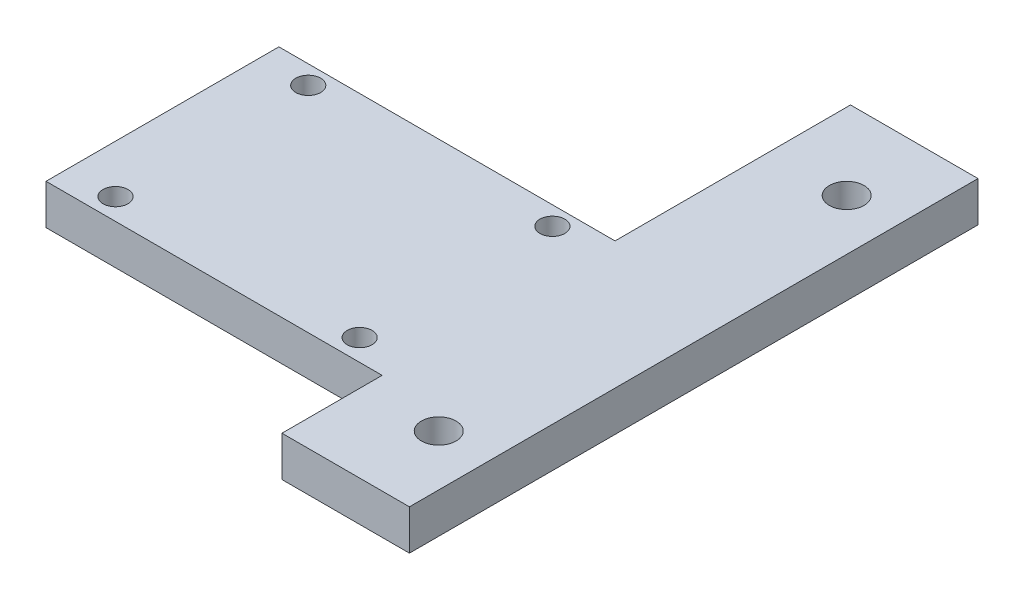
ISO-10303-21;
HEADER;
FILE_DESCRIPTION(('STEP AP214'),'2;1');
FILE_NAME('part.step','',(''),(''),'','','');
FILE_SCHEMA(('AUTOMOTIVE_DESIGN { 1 0 10303 214 1 1 1 1 }'));
ENDSEC;
DATA;
#1=APPLICATION_CONTEXT('core data for automotive mechanical design processes');
#2=APPLICATION_PROTOCOL_DEFINITION('international standard','automotive_design',2000,#1);
#3=PRODUCT_CONTEXT('',#1,'mechanical');
#4=PRODUCT('Part','Part','',(#3));
#5=PRODUCT_RELATED_PRODUCT_CATEGORY('part','',(#4));
#6=PRODUCT_DEFINITION_FORMATION('','',#4);
#7=PRODUCT_DEFINITION_CONTEXT('part definition',#1,'design');
#8=PRODUCT_DEFINITION('design','',#6,#7);
#9=PRODUCT_DEFINITION_SHAPE('','',#8);
#10=(LENGTH_UNIT() NAMED_UNIT(*) SI_UNIT(.MILLI.,.METRE.));
#11=(NAMED_UNIT(*) PLANE_ANGLE_UNIT() SI_UNIT($,.RADIAN.));
#12=(NAMED_UNIT(*) SI_UNIT($,.STERADIAN.) SOLID_ANGLE_UNIT());
#13=UNCERTAINTY_MEASURE_WITH_UNIT(LENGTH_MEASURE(1.E-05),#10,'distance_accuracy_value','');
#14=(GEOMETRIC_REPRESENTATION_CONTEXT(3) GLOBAL_UNCERTAINTY_ASSIGNED_CONTEXT((#13)) GLOBAL_UNIT_ASSIGNED_CONTEXT((#10,
#11,#12)) REPRESENTATION_CONTEXT('',''));
#15=CARTESIAN_POINT('',(0.,0.,0.));
#16=DIRECTION('',(0.,0.,1.));
#17=DIRECTION('',(1.,0.,0.));
#18=AXIS2_PLACEMENT_3D('',#15,#16,#17);
#19=CARTESIAN_POINT('',(0.,5.,0.));
#20=DIRECTION('',(0.,-1.,0.));
#21=DIRECTION('',(0.,0.,-1.));
#22=AXIS2_PLACEMENT_3D('',#19,#20,#21);
#23=PLANE('',#22);
#24=DIRECTION('',(-1.,0.,0.));
#25=VECTOR('',#24,1.);
#26=CARTESIAN_POINT('',(20.675,5.,-27.14922));
#27=LINE('',#26,#25);
#28=CARTESIAN_POINT('',(36.55,5.,-27.14922));
#29=VERTEX_POINT('',#28);
#30=CARTESIAN_POINT('',(20.675,5.,-27.14922));
#31=VERTEX_POINT('',#30);
#32=EDGE_CURVE('E145',#29,#31,#27,.T.);
#33=ORIENTED_EDGE('',*,*,#32,.T.);
#34=DIRECTION('',(0.,0.,1.));
#35=VECTOR('',#34,1.);
#36=CARTESIAN_POINT('',(20.675,5.,2.1739551283588));
#37=LINE('',#36,#35);
#38=CARTESIAN_POINT('',(20.675,5.,2.1739551283588));
#39=VERTEX_POINT('',#38);
#40=EDGE_CURVE('E93',#31,#39,#37,.T.);
#41=ORIENTED_EDGE('',*,*,#40,.T.);
#42=DIRECTION('',(-1.,0.,0.));
#43=VECTOR('',#42,1.);
#44=CARTESIAN_POINT('',(-21.18269604,5.,2.1739551283588));
#45=LINE('',#44,#43);
#46=CARTESIAN_POINT('',(-21.18269604,5.,2.1739551283588));
#47=VERTEX_POINT('',#46);
#48=EDGE_CURVE('E160',#39,#47,#45,.T.);
#49=ORIENTED_EDGE('',*,*,#48,.T.);
#50=DIRECTION('',(0.,0.,1.));
#51=VECTOR('',#50,1.);
#52=CARTESIAN_POINT('',(-21.18269604,5.,31.1739551283588));
#53=LINE('',#52,#51);
#54=CARTESIAN_POINT('',(-21.18269604,5.,31.1739551283588));
#55=VERTEX_POINT('',#54);
#56=EDGE_CURVE('E173',#47,#55,#53,.T.);
#57=ORIENTED_EDGE('',*,*,#56,.T.);
#58=DIRECTION('',(1.,0.,0.));
#59=VECTOR('',#58,1.);
#60=CARTESIAN_POINT('',(20.675,5.,31.1739551283588));
#61=LINE('',#60,#59);
#62=CARTESIAN_POINT('',(20.675,5.,31.1739551283588));
#63=VERTEX_POINT('',#62);
#64=EDGE_CURVE('E112',#55,#63,#61,.T.);
#65=ORIENTED_EDGE('',*,*,#64,.T.);
#66=DIRECTION('',(0.,0.,1.));
#67=VECTOR('',#66,1.);
#68=CARTESIAN_POINT('',(20.675,5.,31.1739551283588));
#69=LINE('',#68,#67);
#70=CARTESIAN_POINT('',(20.675,5.,43.65078));
#71=VERTEX_POINT('',#70);
#72=EDGE_CURVE('E106',#63,#71,#69,.T.);
#73=ORIENTED_EDGE('',*,*,#72,.T.);
#74=DIRECTION('',(1.,0.,0.));
#75=VECTOR('',#74,1.);
#76=CARTESIAN_POINT('',(20.675,5.,43.65078));
#77=LINE('',#76,#75);
#78=CARTESIAN_POINT('',(36.55,5.,43.65078));
#79=VERTEX_POINT('',#78);
#80=EDGE_CURVE('E110',#71,#79,#77,.T.);
#81=ORIENTED_EDGE('',*,*,#80,.T.);
#82=DIRECTION('',(0.,0.,-1.));
#83=VECTOR('',#82,1.);
#84=CARTESIAN_POINT('',(36.55,5.,-27.14922));
#85=LINE('',#84,#83);
#86=EDGE_CURVE('E50',#79,#29,#85,.T.);
#87=ORIENTED_EDGE('',*,*,#86,.T.);
#88=EDGE_LOOP('',(#33,#41,#49,#57,#65,#73,#81,#87));
#89=FACE_BOUND('',#88,.T.);
#90=CARTESIAN_POINT('',(30.2,5.,33.65078));
#91=DIRECTION('',(0.,1.,0.));
#92=DIRECTION('',(0.,0.,-1.));
#93=AXIS2_PLACEMENT_3D('',#90,#91,#92);
#94=CIRCLE('',#93,2.159);
#95=CARTESIAN_POINT('',(30.2,5.,31.49178));
#96=VERTEX_POINT('',#95);
#97=EDGE_CURVE('E134',#96,#96,#94,.T.);
#98=ORIENTED_EDGE('',*,*,#97,.F.);
#99=EDGE_LOOP('',(#98));
#100=FACE_BOUND('',#99,.T.);
#101=CARTESIAN_POINT('',(-15.2,5.,28.50156));
#102=DIRECTION('',(0.,1.,0.));
#103=DIRECTION('',(0.,0.,-1.));
#104=AXIS2_PLACEMENT_3D('',#101,#102,#103);
#105=CIRCLE('',#104,1.55);
#106=CARTESIAN_POINT('',(-15.2,5.,26.95156));
#107=VERTEX_POINT('',#106);
#108=EDGE_CURVE('E182',#107,#107,#105,.T.);
#109=ORIENTED_EDGE('',*,*,#108,.F.);
#110=EDGE_LOOP('',(#109));
#111=FACE_BOUND('',#110,.T.);
#112=CARTESIAN_POINT('',(15.19999,5.,28.50156));
#113=DIRECTION('',(0.,1.,0.));
#114=DIRECTION('',(0.,0.,1.));
#115=AXIS2_PLACEMENT_3D('',#112,#113,#114);
#116=CIRCLE('',#115,1.55);
#117=CARTESIAN_POINT('',(15.19999,5.,30.05156));
#118=VERTEX_POINT('',#117);
#119=EDGE_CURVE('E188',#118,#118,#116,.T.);
#120=ORIENTED_EDGE('',*,*,#119,.F.);
#121=EDGE_LOOP('',(#120));
#122=FACE_BOUND('',#121,.T.);
#123=CARTESIAN_POINT('',(-15.2,5.,4.50156000000001));
#124=DIRECTION('',(0.,1.,0.));
#125=DIRECTION('',(0.,0.,1.));
#126=AXIS2_PLACEMENT_3D('',#123,#124,#125);
#127=CIRCLE('',#126,1.55);
#128=CARTESIAN_POINT('',(-15.2,5.,6.05156000000001));
#129=VERTEX_POINT('',#128);
#130=EDGE_CURVE('E194',#129,#129,#127,.T.);
#131=ORIENTED_EDGE('',*,*,#130,.F.);
#132=EDGE_LOOP('',(#131));
#133=FACE_BOUND('',#132,.T.);
#134=CARTESIAN_POINT('',(15.2,5.,4.50156000000001));
#135=DIRECTION('',(0.,1.,0.));
#136=DIRECTION('',(0.,0.,-1.));
#137=AXIS2_PLACEMENT_3D('',#134,#135,#136);
#138=CIRCLE('',#137,1.55);
#139=CARTESIAN_POINT('',(15.2,5.,2.95156000000001));
#140=VERTEX_POINT('',#139);
#141=EDGE_CURVE('E200',#140,#140,#138,.T.);
#142=ORIENTED_EDGE('',*,*,#141,.F.);
#143=EDGE_LOOP('',(#142));
#144=FACE_BOUND('',#143,.T.);
#145=CARTESIAN_POINT('',(30.2,5.,-17.14922));
#146=DIRECTION('',(0.,1.,0.));
#147=DIRECTION('',(0.,0.,1.));
#148=AXIS2_PLACEMENT_3D('',#145,#146,#147);
#149=CIRCLE('',#148,2.159);
#150=CARTESIAN_POINT('',(30.2,5.,-14.99022));
#151=VERTEX_POINT('',#150);
#152=EDGE_CURVE('E206',#151,#151,#149,.T.);
#153=ORIENTED_EDGE('',*,*,#152,.F.);
#154=EDGE_LOOP('',(#153));
#155=FACE_BOUND('',#154,.T.);
#156=ADVANCED_FACE('F33',(#89,#100,#111,#122,#133,#144,#155),#23,.F.);
#157=CARTESIAN_POINT('',(0.,0.,0.));
#158=DIRECTION('',(0.,-1.,0.));
#159=DIRECTION('',(0.,0.,-1.));
#160=AXIS2_PLACEMENT_3D('',#157,#158,#159);
#161=PLANE('',#160);
#162=CARTESIAN_POINT('',(15.2,0.,4.50156000000001));
#163=DIRECTION('',(0.,1.,0.));
#164=DIRECTION('',(0.,0.,-1.));
#165=AXIS2_PLACEMENT_3D('',#162,#163,#164);
#166=CIRCLE('',#165,1.55);
#167=CARTESIAN_POINT('',(15.2,0.,2.95156000000001));
#168=VERTEX_POINT('',#167);
#169=EDGE_CURVE('E203',#168,#168,#166,.T.);
#170=ORIENTED_EDGE('',*,*,#169,.T.);
#171=EDGE_LOOP('',(#170));
#172=FACE_BOUND('',#171,.T.);
#173=CARTESIAN_POINT('',(15.19999,0.,28.50156));
#174=DIRECTION('',(0.,1.,0.));
#175=DIRECTION('',(0.,0.,1.));
#176=AXIS2_PLACEMENT_3D('',#173,#174,#175);
#177=CIRCLE('',#176,1.55);
#178=CARTESIAN_POINT('',(15.19999,0.,30.05156));
#179=VERTEX_POINT('',#178);
#180=EDGE_CURVE('E191',#179,#179,#177,.T.);
#181=ORIENTED_EDGE('',*,*,#180,.T.);
#182=EDGE_LOOP('',(#181));
#183=FACE_BOUND('',#182,.T.);
#184=CARTESIAN_POINT('',(30.2,0.,33.65078));
#185=DIRECTION('',(0.,1.,0.));
#186=DIRECTION('',(0.,0.,-1.));
#187=AXIS2_PLACEMENT_3D('',#184,#185,#186);
#188=CIRCLE('',#187,2.159);
#189=CARTESIAN_POINT('',(30.2,0.,31.49178));
#190=VERTEX_POINT('',#189);
#191=EDGE_CURVE('E179',#190,#190,#188,.T.);
#192=ORIENTED_EDGE('',*,*,#191,.T.);
#193=EDGE_LOOP('',(#192));
#194=FACE_BOUND('',#193,.T.);
#195=DIRECTION('',(-1.,0.,0.));
#196=VECTOR('',#195,1.);
#197=CARTESIAN_POINT('',(20.675,0.,-27.14922));
#198=LINE('',#197,#196);
#199=CARTESIAN_POINT('',(36.55,0.,-27.14922));
#200=VERTEX_POINT('',#199);
#201=CARTESIAN_POINT('',(20.675,0.,-27.14922));
#202=VERTEX_POINT('',#201);
#203=EDGE_CURVE('E130',#200,#202,#198,.T.);
#204=ORIENTED_EDGE('',*,*,#203,.F.);
#205=DIRECTION('',(0.,0.,-1.));
#206=VECTOR('',#205,1.);
#207=CARTESIAN_POINT('',(36.55,0.,-27.14922));
#208=LINE('',#207,#206);
#209=CARTESIAN_POINT('',(36.55,0.,43.65078));
#210=VERTEX_POINT('',#209);
#211=EDGE_CURVE('E85',#210,#200,#208,.T.);
#212=ORIENTED_EDGE('',*,*,#211,.F.);
#213=DIRECTION('',(1.,0.,0.));
#214=VECTOR('',#213,1.);
#215=CARTESIAN_POINT('',(20.675,0.,43.65078));
#216=LINE('',#215,#214);
#217=CARTESIAN_POINT('',(20.675,0.,43.65078));
#218=VERTEX_POINT('',#217);
#219=EDGE_CURVE('E79',#218,#210,#216,.T.);
#220=ORIENTED_EDGE('',*,*,#219,.F.);
#221=DIRECTION('',(0.,0.,1.));
#222=VECTOR('',#221,1.);
#223=CARTESIAN_POINT('',(20.675,0.,31.1739551283588));
#224=LINE('',#223,#222);
#225=CARTESIAN_POINT('',(20.675,0.,31.1739551283588));
#226=VERTEX_POINT('',#225);
#227=EDGE_CURVE('E120',#226,#218,#224,.T.);
#228=ORIENTED_EDGE('',*,*,#227,.F.);
#229=DIRECTION('',(1.,0.,0.));
#230=VECTOR('',#229,1.);
#231=CARTESIAN_POINT('',(20.675,0.,31.1739551283588));
#232=LINE('',#231,#230);
#233=CARTESIAN_POINT('',(-21.18269604,0.,31.1739551283588));
#234=VERTEX_POINT('',#233);
#235=EDGE_CURVE('E140',#234,#226,#232,.T.);
#236=ORIENTED_EDGE('',*,*,#235,.F.);
#237=DIRECTION('',(0.,0.,1.));
#238=VECTOR('',#237,1.);
#239=CARTESIAN_POINT('',(-21.18269604,0.,31.1739551283588));
#240=LINE('',#239,#238);
#241=CARTESIAN_POINT('',(-21.18269604,0.,2.1739551283588));
#242=VERTEX_POINT('',#241);
#243=EDGE_CURVE('E138',#242,#234,#240,.T.);
#244=ORIENTED_EDGE('',*,*,#243,.F.);
#245=DIRECTION('',(-1.,0.,0.));
#246=VECTOR('',#245,1.);
#247=CARTESIAN_POINT('',(-21.18269604,0.,2.1739551283588));
#248=LINE('',#247,#246);
#249=CARTESIAN_POINT('',(20.675,0.,2.1739551283588));
#250=VERTEX_POINT('',#249);
#251=EDGE_CURVE('E136',#250,#242,#248,.T.);
#252=ORIENTED_EDGE('',*,*,#251,.F.);
#253=DIRECTION('',(0.,0.,1.));
#254=VECTOR('',#253,1.);
#255=CARTESIAN_POINT('',(20.675,0.,2.1739551283588));
#256=LINE('',#255,#254);
#257=EDGE_CURVE('E133',#202,#250,#256,.T.);
#258=ORIENTED_EDGE('',*,*,#257,.F.);
#259=EDGE_LOOP('',(#204,#212,#220,#228,#236,#244,#252,#258));
#260=FACE_BOUND('',#259,.T.);
#261=CARTESIAN_POINT('',(-15.2,0.,28.50156));
#262=DIRECTION('',(0.,1.,0.));
#263=DIRECTION('',(0.,0.,-1.));
#264=AXIS2_PLACEMENT_3D('',#261,#262,#263);
#265=CIRCLE('',#264,1.55);
#266=CARTESIAN_POINT('',(-15.2,0.,26.95156));
#267=VERTEX_POINT('',#266);
#268=EDGE_CURVE('E185',#267,#267,#265,.T.);
#269=ORIENTED_EDGE('',*,*,#268,.T.);
#270=EDGE_LOOP('',(#269));
#271=FACE_BOUND('',#270,.T.);
#272=CARTESIAN_POINT('',(-15.2,0.,4.50156000000001));
#273=DIRECTION('',(0.,1.,0.));
#274=DIRECTION('',(0.,0.,1.));
#275=AXIS2_PLACEMENT_3D('',#272,#273,#274);
#276=CIRCLE('',#275,1.55);
#277=CARTESIAN_POINT('',(-15.2,0.,6.05156000000001));
#278=VERTEX_POINT('',#277);
#279=EDGE_CURVE('E197',#278,#278,#276,.T.);
#280=ORIENTED_EDGE('',*,*,#279,.T.);
#281=EDGE_LOOP('',(#280));
#282=FACE_BOUND('',#281,.T.);
#283=CARTESIAN_POINT('',(30.2,0.,-17.14922));
#284=DIRECTION('',(0.,1.,0.));
#285=DIRECTION('',(0.,0.,1.));
#286=AXIS2_PLACEMENT_3D('',#283,#284,#285);
#287=CIRCLE('',#286,2.159);
#288=CARTESIAN_POINT('',(30.2,0.,-14.99022));
#289=VERTEX_POINT('',#288);
#290=EDGE_CURVE('E209',#289,#289,#287,.T.);
#291=ORIENTED_EDGE('',*,*,#290,.T.);
#292=EDGE_LOOP('',(#291));
#293=FACE_BOUND('',#292,.T.);
#294=ADVANCED_FACE('F164',(#172,#183,#194,#260,#271,#282,#293),#161,.T.);
#295=CARTESIAN_POINT('',(20.675,5.,-27.14922));
#296=DIRECTION('',(0.,0.,1.));
#297=DIRECTION('',(1.,0.,0.));
#298=AXIS2_PLACEMENT_3D('',#295,#296,#297);
#299=PLANE('',#298);
#300=ORIENTED_EDGE('',*,*,#203,.T.);
#301=DIRECTION('',(0.,-1.,0.));
#302=VECTOR('',#301,1.);
#303=CARTESIAN_POINT('',(20.675,5.,-27.14922));
#304=LINE('',#303,#302);
#305=EDGE_CURVE('E11',#31,#202,#304,.T.);
#306=ORIENTED_EDGE('',*,*,#305,.F.);
#307=ORIENTED_EDGE('',*,*,#32,.F.);
#308=DIRECTION('',(0.,-1.,0.));
#309=VECTOR('',#308,1.);
#310=CARTESIAN_POINT('',(36.55,5.,-27.14922));
#311=LINE('',#310,#309);
#312=EDGE_CURVE('E126',#29,#200,#311,.T.);
#313=ORIENTED_EDGE('',*,*,#312,.T.);
#314=EDGE_LOOP('',(#300,#306,#307,#313));
#315=FACE_BOUND('',#314,.T.);
#316=ADVANCED_FACE('F35',(#315),#299,.F.);
#317=CARTESIAN_POINT('',(20.675,5.,2.1739551283588));
#318=DIRECTION('',(1.,0.,0.));
#319=DIRECTION('',(0.,0.,-1.));
#320=AXIS2_PLACEMENT_3D('',#317,#318,#319);
#321=PLANE('',#320);
#322=ORIENTED_EDGE('',*,*,#257,.T.);
#323=DIRECTION('',(0.,-1.,0.));
#324=VECTOR('',#323,1.);
#325=CARTESIAN_POINT('',(20.675,5.,2.1739551283588));
#326=LINE('',#325,#324);
#327=EDGE_CURVE('E42',#39,#250,#326,.T.);
#328=ORIENTED_EDGE('',*,*,#327,.F.);
#329=ORIENTED_EDGE('',*,*,#40,.F.);
#330=ORIENTED_EDGE('',*,*,#305,.T.);
#331=EDGE_LOOP('',(#322,#328,#329,#330));
#332=FACE_BOUND('',#331,.T.);
#333=ADVANCED_FACE('F241',(#332),#321,.F.);
#334=CARTESIAN_POINT('',(-21.18269604,5.,2.1739551283588));
#335=DIRECTION('',(0.,0.,1.));
#336=DIRECTION('',(1.,0.,0.));
#337=AXIS2_PLACEMENT_3D('',#334,#335,#336);
#338=PLANE('',#337);
#339=ORIENTED_EDGE('',*,*,#251,.T.);
#340=DIRECTION('',(0.,-1.,0.));
#341=VECTOR('',#340,1.);
#342=CARTESIAN_POINT('',(-21.18269604,5.,2.1739551283588));
#343=LINE('',#342,#341);
#344=EDGE_CURVE('E152',#47,#242,#343,.T.);
#345=ORIENTED_EDGE('',*,*,#344,.F.);
#346=ORIENTED_EDGE('',*,*,#48,.F.);
#347=ORIENTED_EDGE('',*,*,#327,.T.);
#348=EDGE_LOOP('',(#339,#345,#346,#347));
#349=FACE_BOUND('',#348,.T.);
#350=ADVANCED_FACE('F158',(#349),#338,.F.);
#351=CARTESIAN_POINT('',(-21.18269604,5.,31.1739551283588));
#352=DIRECTION('',(1.,0.,0.));
#353=DIRECTION('',(0.,0.,-1.));
#354=AXIS2_PLACEMENT_3D('',#351,#352,#353);
#355=PLANE('',#354);
#356=ORIENTED_EDGE('',*,*,#243,.T.);
#357=DIRECTION('',(0.,-1.,0.));
#358=VECTOR('',#357,1.);
#359=CARTESIAN_POINT('',(-21.18269604,5.,31.1739551283588));
#360=LINE('',#359,#358);
#361=EDGE_CURVE('E149',#55,#234,#360,.T.);
#362=ORIENTED_EDGE('',*,*,#361,.F.);
#363=ORIENTED_EDGE('',*,*,#56,.F.);
#364=ORIENTED_EDGE('',*,*,#344,.T.);
#365=EDGE_LOOP('',(#356,#362,#363,#364));
#366=FACE_BOUND('',#365,.T.);
#367=ADVANCED_FACE('F169',(#366),#355,.F.);
#368=CARTESIAN_POINT('',(20.675,5.,31.1739551283588));
#369=DIRECTION('',(0.,0.,-1.));
#370=DIRECTION('',(-1.,0.,0.));
#371=AXIS2_PLACEMENT_3D('',#368,#369,#370);
#372=PLANE('',#371);
#373=ORIENTED_EDGE('',*,*,#235,.T.);
#374=DIRECTION('',(0.,-1.,0.));
#375=VECTOR('',#374,1.);
#376=CARTESIAN_POINT('',(20.675,5.,31.1739551283588));
#377=LINE('',#376,#375);
#378=EDGE_CURVE('E121',#63,#226,#377,.T.);
#379=ORIENTED_EDGE('',*,*,#378,.F.);
#380=ORIENTED_EDGE('',*,*,#64,.F.);
#381=ORIENTED_EDGE('',*,*,#361,.T.);
#382=EDGE_LOOP('',(#373,#379,#380,#381));
#383=FACE_BOUND('',#382,.T.);
#384=ADVANCED_FACE('F172',(#383),#372,.F.);
#385=CARTESIAN_POINT('',(20.675,5.,31.1739551283588));
#386=DIRECTION('',(1.,0.,0.));
#387=DIRECTION('',(0.,0.,-1.));
#388=AXIS2_PLACEMENT_3D('',#385,#386,#387);
#389=PLANE('',#388);
#390=ORIENTED_EDGE('',*,*,#227,.T.);
#391=DIRECTION('',(0.,-1.,0.));
#392=VECTOR('',#391,1.);
#393=CARTESIAN_POINT('',(20.675,5.,43.65078));
#394=LINE('',#393,#392);
#395=EDGE_CURVE('E117',#71,#218,#394,.T.);
#396=ORIENTED_EDGE('',*,*,#395,.F.);
#397=ORIENTED_EDGE('',*,*,#72,.F.);
#398=ORIENTED_EDGE('',*,*,#378,.T.);
#399=EDGE_LOOP('',(#390,#396,#397,#398));
#400=FACE_BOUND('',#399,.T.);
#401=ADVANCED_FACE('F118',(#400),#389,.F.);
#402=CARTESIAN_POINT('',(20.675,5.,43.65078));
#403=DIRECTION('',(0.,0.,-1.));
#404=DIRECTION('',(-1.,0.,0.));
#405=AXIS2_PLACEMENT_3D('',#402,#403,#404);
#406=PLANE('',#405);
#407=ORIENTED_EDGE('',*,*,#219,.T.);
#408=DIRECTION('',(0.,-1.,0.));
#409=VECTOR('',#408,1.);
#410=CARTESIAN_POINT('',(36.55,5.,43.65078));
#411=LINE('',#410,#409);
#412=EDGE_CURVE('E122',#79,#210,#411,.T.);
#413=ORIENTED_EDGE('',*,*,#412,.F.);
#414=ORIENTED_EDGE('',*,*,#80,.F.);
#415=ORIENTED_EDGE('',*,*,#395,.T.);
#416=EDGE_LOOP('',(#407,#413,#414,#415));
#417=FACE_BOUND('',#416,.T.);
#418=ADVANCED_FACE('F124',(#417),#406,.F.);
#419=CARTESIAN_POINT('',(36.55,5.,-27.14922));
#420=DIRECTION('',(-1.,0.,0.));
#421=DIRECTION('',(0.,0.,1.));
#422=AXIS2_PLACEMENT_3D('',#419,#420,#421);
#423=PLANE('',#422);
#424=ORIENTED_EDGE('',*,*,#211,.T.);
#425=ORIENTED_EDGE('',*,*,#312,.F.);
#426=ORIENTED_EDGE('',*,*,#86,.F.);
#427=ORIENTED_EDGE('',*,*,#412,.T.);
#428=EDGE_LOOP('',(#424,#425,#426,#427));
#429=FACE_BOUND('',#428,.T.);
#430=ADVANCED_FACE('F229',(#429),#423,.F.);
#431=CARTESIAN_POINT('',(30.2,5.,33.65078));
#432=DIRECTION('',(0.,-1.,0.));
#433=DIRECTION('',(0.,0.,-1.));
#434=AXIS2_PLACEMENT_3D('',#431,#432,#433);
#435=CYLINDRICAL_SURFACE('',#434,2.159);
#436=ORIENTED_EDGE('',*,*,#97,.T.);
#437=EDGE_LOOP('',(#436));
#438=FACE_BOUND('',#437,.T.);
#439=ORIENTED_EDGE('',*,*,#191,.F.);
#440=EDGE_LOOP('',(#439));
#441=FACE_BOUND('',#440,.T.);
#442=ADVANCED_FACE('F226',(#438,#441),#435,.F.);
#443=CARTESIAN_POINT('',(-15.2,5.,28.50156));
#444=DIRECTION('',(0.,-1.,0.));
#445=DIRECTION('',(0.,0.,-1.));
#446=AXIS2_PLACEMENT_3D('',#443,#444,#445);
#447=CYLINDRICAL_SURFACE('',#446,1.55);
#448=ORIENTED_EDGE('',*,*,#108,.T.);
#449=EDGE_LOOP('',(#448));
#450=FACE_BOUND('',#449,.T.);
#451=ORIENTED_EDGE('',*,*,#268,.F.);
#452=EDGE_LOOP('',(#451));
#453=FACE_BOUND('',#452,.T.);
#454=ADVANCED_FACE('F305',(#450,#453),#447,.F.);
#455=CARTESIAN_POINT('',(15.19999,5.,28.50156));
#456=DIRECTION('',(0.,-1.,0.));
#457=DIRECTION('',(0.,0.,-1.));
#458=AXIS2_PLACEMENT_3D('',#455,#456,#457);
#459=CYLINDRICAL_SURFACE('',#458,1.55);
#460=ORIENTED_EDGE('',*,*,#119,.T.);
#461=EDGE_LOOP('',(#460));
#462=FACE_BOUND('',#461,.T.);
#463=ORIENTED_EDGE('',*,*,#180,.F.);
#464=EDGE_LOOP('',(#463));
#465=FACE_BOUND('',#464,.T.);
#466=ADVANCED_FACE('F313',(#462,#465),#459,.F.);
#467=CARTESIAN_POINT('',(-15.2,5.,4.50156000000001));
#468=DIRECTION('',(0.,-1.,0.));
#469=DIRECTION('',(0.,0.,-1.));
#470=AXIS2_PLACEMENT_3D('',#467,#468,#469);
#471=CYLINDRICAL_SURFACE('',#470,1.55);
#472=ORIENTED_EDGE('',*,*,#130,.T.);
#473=EDGE_LOOP('',(#472));
#474=FACE_BOUND('',#473,.T.);
#475=ORIENTED_EDGE('',*,*,#279,.F.);
#476=EDGE_LOOP('',(#475));
#477=FACE_BOUND('',#476,.T.);
#478=ADVANCED_FACE('F321',(#474,#477),#471,.F.);
#479=CARTESIAN_POINT('',(15.2,5.,4.50156000000001));
#480=DIRECTION('',(0.,-1.,0.));
#481=DIRECTION('',(0.,0.,-1.));
#482=AXIS2_PLACEMENT_3D('',#479,#480,#481);
#483=CYLINDRICAL_SURFACE('',#482,1.55);
#484=ORIENTED_EDGE('',*,*,#141,.T.);
#485=EDGE_LOOP('',(#484));
#486=FACE_BOUND('',#485,.T.);
#487=ORIENTED_EDGE('',*,*,#169,.F.);
#488=EDGE_LOOP('',(#487));
#489=FACE_BOUND('',#488,.T.);
#490=ADVANCED_FACE('F330',(#486,#489),#483,.F.);
#491=CARTESIAN_POINT('',(30.2,5.,-17.14922));
#492=DIRECTION('',(0.,-1.,0.));
#493=DIRECTION('',(0.,0.,-1.));
#494=AXIS2_PLACEMENT_3D('',#491,#492,#493);
#495=CYLINDRICAL_SURFACE('',#494,2.159);
#496=ORIENTED_EDGE('',*,*,#152,.T.);
#497=EDGE_LOOP('',(#496));
#498=FACE_BOUND('',#497,.T.);
#499=ORIENTED_EDGE('',*,*,#290,.F.);
#500=EDGE_LOOP('',(#499));
#501=FACE_BOUND('',#500,.T.);
#502=ADVANCED_FACE('F215',(#498,#501),#495,.F.);
#503=CLOSED_SHELL('',(#156,#294,#316,#333,#350,#367,#384,#401,#418,#430,#442,#454,#466,#478,
#490,#502));
#504=MANIFOLD_SOLID_BREP('B2',#503);
#505=ADVANCED_BREP_SHAPE_REPRESENTATION('',(#18,#504),#14);
#506=SHAPE_DEFINITION_REPRESENTATION(#9,#505);
ENDSEC;
END-ISO-10303-21;
